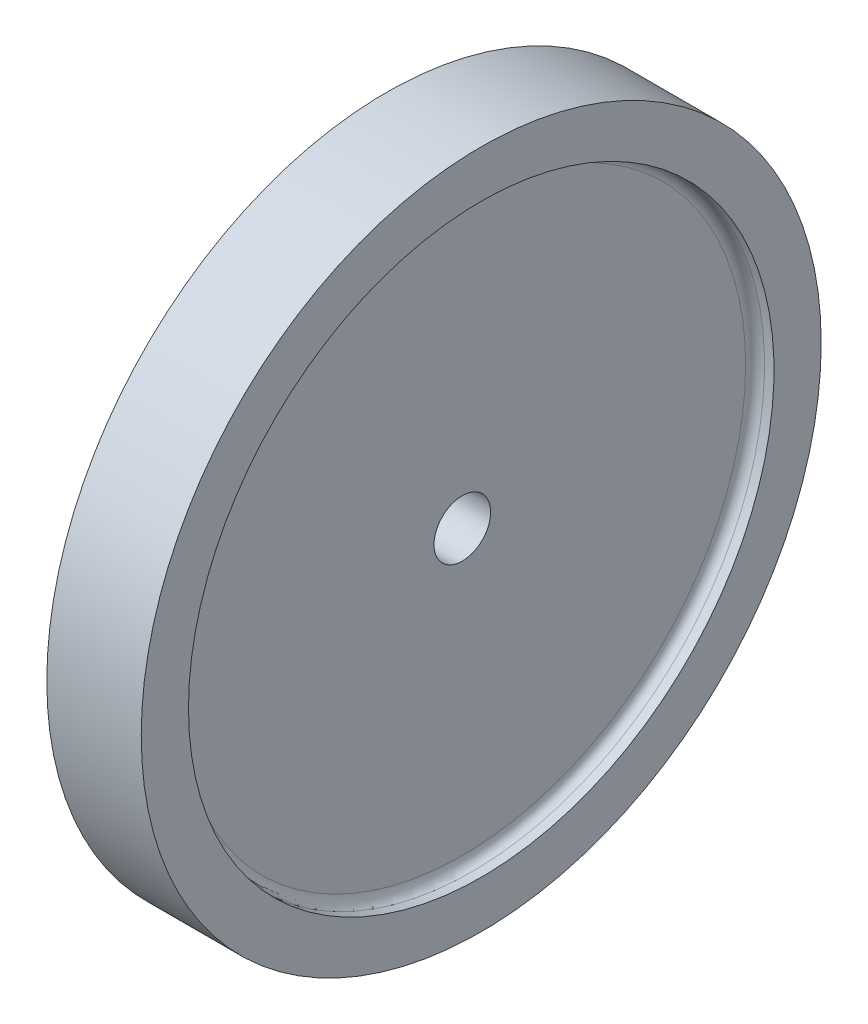
ISO-10303-21;
HEADER;
FILE_DESCRIPTION(('STEP AP214'),'2;1');
FILE_NAME('part.step','',(''),(''),'','','');
FILE_SCHEMA(('AUTOMOTIVE_DESIGN { 1 0 10303 214 1 1 1 1 }'));
ENDSEC;
DATA;
#1=APPLICATION_CONTEXT('core data for automotive mechanical design processes');
#2=APPLICATION_PROTOCOL_DEFINITION('international standard','automotive_design',2000,#1);
#3=PRODUCT_CONTEXT('',#1,'mechanical');
#4=PRODUCT('Part','Part','',(#3));
#5=PRODUCT_RELATED_PRODUCT_CATEGORY('part','',(#4));
#6=PRODUCT_DEFINITION_FORMATION('','',#4);
#7=PRODUCT_DEFINITION_CONTEXT('part definition',#1,'design');
#8=PRODUCT_DEFINITION('design','',#6,#7);
#9=PRODUCT_DEFINITION_SHAPE('','',#8);
#10=(LENGTH_UNIT() NAMED_UNIT(*) SI_UNIT(.MILLI.,.METRE.));
#11=(NAMED_UNIT(*) PLANE_ANGLE_UNIT() SI_UNIT($,.RADIAN.));
#12=(NAMED_UNIT(*) SI_UNIT($,.STERADIAN.) SOLID_ANGLE_UNIT());
#13=UNCERTAINTY_MEASURE_WITH_UNIT(LENGTH_MEASURE(1.E-05),#10,'distance_accuracy_value','');
#14=(GEOMETRIC_REPRESENTATION_CONTEXT(3) GLOBAL_UNCERTAINTY_ASSIGNED_CONTEXT((#13)) GLOBAL_UNIT_ASSIGNED_CONTEXT((#10,
#11,#12)) REPRESENTATION_CONTEXT('',''));
#15=CARTESIAN_POINT('',(0.,0.,0.));
#16=DIRECTION('',(0.,0.,1.));
#17=DIRECTION('',(1.,0.,0.));
#18=AXIS2_PLACEMENT_3D('',#15,#16,#17);
#19=CARTESIAN_POINT('',(-3.,0.,0.));
#20=DIRECTION('',(1.,0.,0.));
#21=DIRECTION('',(0.,0.,-1.));
#22=AXIS2_PLACEMENT_3D('',#19,#20,#21);
#23=PLANE('',#22);
#24=CARTESIAN_POINT('',(-3.,0.,0.));
#25=DIRECTION('',(1.,0.,0.));
#26=DIRECTION('',(0.,0.,-1.));
#27=AXIS2_PLACEMENT_3D('',#24,#25,#26);
#28=CIRCLE('',#27,30.);
#29=CARTESIAN_POINT('',(-3.,0.,-30.));
#30=VERTEX_POINT('',#29);
#31=EDGE_CURVE('E48',#30,#30,#28,.F.);
#32=ORIENTED_EDGE('',*,*,#31,.T.);
#33=EDGE_LOOP('',(#32));
#34=FACE_BOUND('',#33,.T.);
#35=CARTESIAN_POINT('',(-3.,0.,0.));
#36=DIRECTION('',(1.,0.,0.));
#37=DIRECTION('',(0.,0.,-1.));
#38=AXIS2_PLACEMENT_3D('',#35,#36,#37);
#39=CIRCLE('',#38,3.);
#40=CARTESIAN_POINT('',(-3.,0.,-3.));
#41=VERTEX_POINT('',#40);
#42=EDGE_CURVE('E65',#41,#41,#39,.T.);
#43=ORIENTED_EDGE('',*,*,#42,.T.);
#44=EDGE_LOOP('',(#43));
#45=FACE_BOUND('',#44,.T.);
#46=ADVANCED_FACE('F33',(#34,#45),#23,.F.);
#47=CARTESIAN_POINT('',(3.,0.,0.));
#48=DIRECTION('',(-1.,0.,0.));
#49=DIRECTION('',(0.,0.,1.));
#50=AXIS2_PLACEMENT_3D('',#47,#48,#49);
#51=PLANE('',#50);
#52=CARTESIAN_POINT('',(3.,0.,0.));
#53=DIRECTION('',(-1.,0.,0.));
#54=DIRECTION('',(0.,0.,1.));
#55=AXIS2_PLACEMENT_3D('',#52,#53,#54);
#56=CIRCLE('',#55,30.);
#57=CARTESIAN_POINT('',(3.,0.,30.));
#58=VERTEX_POINT('',#57);
#59=EDGE_CURVE('E10',#58,#58,#56,.F.);
#60=ORIENTED_EDGE('',*,*,#59,.T.);
#61=EDGE_LOOP('',(#60));
#62=FACE_BOUND('',#61,.T.);
#63=CARTESIAN_POINT('',(3.,0.,0.));
#64=DIRECTION('',(1.,0.,0.));
#65=DIRECTION('',(0.,0.,-1.));
#66=AXIS2_PLACEMENT_3D('',#63,#64,#65);
#67=CIRCLE('',#66,3.);
#68=CARTESIAN_POINT('',(3.,0.,-3.));
#69=VERTEX_POINT('',#68);
#70=EDGE_CURVE('E68',#69,#69,#67,.T.);
#71=ORIENTED_EDGE('',*,*,#70,.F.);
#72=EDGE_LOOP('',(#71));
#73=FACE_BOUND('',#72,.T.);
#74=ADVANCED_FACE('F75',(#62,#73),#51,.F.);
#75=CARTESIAN_POINT('',(-3.,0.,0.));
#76=DIRECTION('',(-1.,0.,0.));
#77=DIRECTION('',(0.,0.,1.));
#78=AXIS2_PLACEMENT_3D('',#75,#76,#77);
#79=CYLINDRICAL_SURFACE('',#78,31.);
#80=CARTESIAN_POINT('',(4.,0.,0.));
#81=DIRECTION('',(-1.,0.,0.));
#82=DIRECTION('',(0.,0.,1.));
#83=AXIS2_PLACEMENT_3D('',#80,#81,#82);
#84=CIRCLE('',#83,31.);
#85=CARTESIAN_POINT('',(4.,0.,31.));
#86=VERTEX_POINT('',#85);
#87=EDGE_CURVE('E40',#86,#86,#84,.T.);
#88=ORIENTED_EDGE('',*,*,#87,.T.);
#89=EDGE_LOOP('',(#88));
#90=FACE_BOUND('',#89,.T.);
#91=CARTESIAN_POINT('',(5.,0.,0.));
#92=DIRECTION('',(-1.,0.,0.));
#93=DIRECTION('',(0.,0.,1.));
#94=AXIS2_PLACEMENT_3D('',#91,#92,#93);
#95=CIRCLE('',#94,31.);
#96=CARTESIAN_POINT('',(5.,0.,31.));
#97=VERTEX_POINT('',#96);
#98=EDGE_CURVE('E53',#97,#97,#95,.T.);
#99=ORIENTED_EDGE('',*,*,#98,.F.);
#100=EDGE_LOOP('',(#99));
#101=FACE_BOUND('',#100,.T.);
#102=ADVANCED_FACE('F77',(#90,#101),#79,.F.);
#103=CARTESIAN_POINT('',(5.,36.,0.));
#104=DIRECTION('',(-1.,0.,0.));
#105=DIRECTION('',(0.,0.,1.));
#106=AXIS2_PLACEMENT_3D('',#103,#104,#105);
#107=PLANE('',#106);
#108=CARTESIAN_POINT('',(5.,0.,0.));
#109=DIRECTION('',(-1.,0.,0.));
#110=DIRECTION('',(0.,0.,1.));
#111=AXIS2_PLACEMENT_3D('',#108,#109,#110);
#112=CIRCLE('',#111,36.);
#113=CARTESIAN_POINT('',(5.,0.,36.));
#114=VERTEX_POINT('',#113);
#115=EDGE_CURVE('E56',#114,#114,#112,.T.);
#116=ORIENTED_EDGE('',*,*,#115,.F.);
#117=EDGE_LOOP('',(#116));
#118=FACE_BOUND('',#117,.T.);
#119=ORIENTED_EDGE('',*,*,#98,.T.);
#120=EDGE_LOOP('',(#119));
#121=FACE_BOUND('',#120,.T.);
#122=ADVANCED_FACE('F83',(#118,#121),#107,.F.);
#123=CARTESIAN_POINT('',(-3.,0.,0.));
#124=DIRECTION('',(-1.,0.,0.));
#125=DIRECTION('',(0.,0.,1.));
#126=AXIS2_PLACEMENT_3D('',#123,#124,#125);
#127=CYLINDRICAL_SURFACE('',#126,36.);
#128=CARTESIAN_POINT('',(-5.,0.,0.));
#129=DIRECTION('',(-1.,0.,0.));
#130=DIRECTION('',(0.,0.,1.));
#131=AXIS2_PLACEMENT_3D('',#128,#129,#130);
#132=CIRCLE('',#131,36.);
#133=CARTESIAN_POINT('',(-5.,0.,36.));
#134=VERTEX_POINT('',#133);
#135=EDGE_CURVE('E59',#134,#134,#132,.T.);
#136=ORIENTED_EDGE('',*,*,#135,.F.);
#137=EDGE_LOOP('',(#136));
#138=FACE_BOUND('',#137,.T.);
#139=ORIENTED_EDGE('',*,*,#115,.T.);
#140=EDGE_LOOP('',(#139));
#141=FACE_BOUND('',#140,.T.);
#142=ADVANCED_FACE('F112',(#138,#141),#127,.T.);
#143=CARTESIAN_POINT('',(-5.,31.,0.));
#144=DIRECTION('',(1.,0.,0.));
#145=DIRECTION('',(0.,0.,-1.));
#146=AXIS2_PLACEMENT_3D('',#143,#144,#145);
#147=PLANE('',#146);
#148=CARTESIAN_POINT('',(-5.,0.,0.));
#149=DIRECTION('',(-1.,0.,0.));
#150=DIRECTION('',(0.,0.,1.));
#151=AXIS2_PLACEMENT_3D('',#148,#149,#150);
#152=CIRCLE('',#151,31.);
#153=CARTESIAN_POINT('',(-5.,0.,31.));
#154=VERTEX_POINT('',#153);
#155=EDGE_CURVE('E62',#154,#154,#152,.T.);
#156=ORIENTED_EDGE('',*,*,#155,.F.);
#157=EDGE_LOOP('',(#156));
#158=FACE_BOUND('',#157,.T.);
#159=ORIENTED_EDGE('',*,*,#135,.T.);
#160=EDGE_LOOP('',(#159));
#161=FACE_BOUND('',#160,.T.);
#162=ADVANCED_FACE('F106',(#158,#161),#147,.F.);
#163=CARTESIAN_POINT('',(-3.,0.,0.));
#164=DIRECTION('',(-1.,0.,0.));
#165=DIRECTION('',(0.,0.,1.));
#166=AXIS2_PLACEMENT_3D('',#163,#164,#165);
#167=CYLINDRICAL_SURFACE('',#166,31.);
#168=CARTESIAN_POINT('',(-4.,0.,0.));
#169=DIRECTION('',(1.,0.,0.));
#170=DIRECTION('',(0.,0.,-1.));
#171=AXIS2_PLACEMENT_3D('',#168,#169,#170);
#172=CIRCLE('',#171,31.);
#173=CARTESIAN_POINT('',(-4.,0.,-31.));
#174=VERTEX_POINT('',#173);
#175=EDGE_CURVE('E44',#174,#174,#172,.T.);
#176=ORIENTED_EDGE('',*,*,#175,.T.);
#177=EDGE_LOOP('',(#176));
#178=FACE_BOUND('',#177,.T.);
#179=ORIENTED_EDGE('',*,*,#155,.T.);
#180=EDGE_LOOP('',(#179));
#181=FACE_BOUND('',#180,.T.);
#182=ADVANCED_FACE('F96',(#178,#181),#167,.F.);
#183=CARTESIAN_POINT('',(-5.,0.,0.));
#184=DIRECTION('',(1.,0.,0.));
#185=DIRECTION('',(0.,0.,-1.));
#186=AXIS2_PLACEMENT_3D('',#183,#184,#185);
#187=CYLINDRICAL_SURFACE('',#186,3.);
#188=ORIENTED_EDGE('',*,*,#70,.T.);
#189=EDGE_LOOP('',(#188));
#190=FACE_BOUND('',#189,.T.);
#191=ORIENTED_EDGE('',*,*,#42,.F.);
#192=EDGE_LOOP('',(#191));
#193=FACE_BOUND('',#192,.T.);
#194=ADVANCED_FACE('F72',(#190,#193),#187,.F.);
#195=CARTESIAN_POINT('',(-4.,0.,0.));
#196=DIRECTION('',(1.,0.,0.));
#197=DIRECTION('',(0.,0.,-1.));
#198=AXIS2_PLACEMENT_3D('',#195,#196,#197);
#199=TOROIDAL_SURFACE('',#198,30.,1.);
#200=ORIENTED_EDGE('',*,*,#175,.F.);
#201=EDGE_LOOP('',(#200));
#202=FACE_BOUND('',#201,.T.);
#203=ORIENTED_EDGE('',*,*,#31,.F.);
#204=EDGE_LOOP('',(#203));
#205=FACE_BOUND('',#204,.T.);
#206=ADVANCED_FACE('F88',(#202,#205),#199,.F.);
#207=CARTESIAN_POINT('',(4.,0.,0.));
#208=DIRECTION('',(-1.,0.,0.));
#209=DIRECTION('',(0.,0.,1.));
#210=AXIS2_PLACEMENT_3D('',#207,#208,#209);
#211=TOROIDAL_SURFACE('',#210,30.,1.);
#212=ORIENTED_EDGE('',*,*,#59,.F.);
#213=EDGE_LOOP('',(#212));
#214=FACE_BOUND('',#213,.T.);
#215=ORIENTED_EDGE('',*,*,#87,.F.);
#216=EDGE_LOOP('',(#215));
#217=FACE_BOUND('',#216,.T.);
#218=ADVANCED_FACE('F35',(#214,#217),#211,.F.);
#219=CLOSED_SHELL('',(#46,#74,#102,#122,#142,#162,#182,#194,#206,#218));
#220=MANIFOLD_SOLID_BREP('B2',#219);
#221=ADVANCED_BREP_SHAPE_REPRESENTATION('',(#18,#220),#14);
#222=SHAPE_DEFINITION_REPRESENTATION(#9,#221);
ENDSEC;
END-ISO-10303-21;
